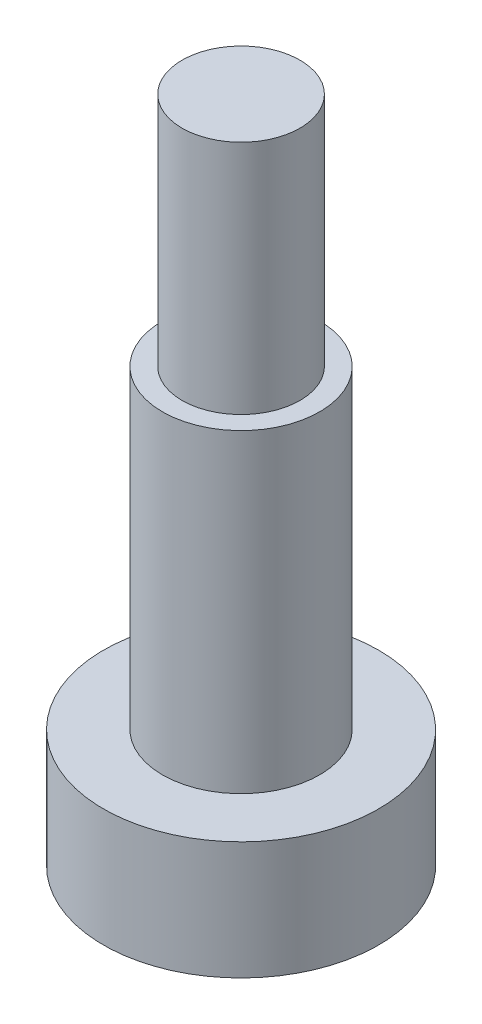
ISO-10303-21;
HEADER;
FILE_DESCRIPTION(('STEP AP214'),'2;1');
FILE_NAME('part.step','',(''),(''),'','','');
FILE_SCHEMA(('AUTOMOTIVE_DESIGN { 1 0 10303 214 1 1 1 1 }'));
ENDSEC;
DATA;
#1=APPLICATION_CONTEXT('core data for automotive mechanical design processes');
#2=APPLICATION_PROTOCOL_DEFINITION('international standard','automotive_design',2000,#1);
#3=PRODUCT_CONTEXT('',#1,'mechanical');
#4=PRODUCT('Part','Part','',(#3));
#5=PRODUCT_RELATED_PRODUCT_CATEGORY('part','',(#4));
#6=PRODUCT_DEFINITION_FORMATION('','',#4);
#7=PRODUCT_DEFINITION_CONTEXT('part definition',#1,'design');
#8=PRODUCT_DEFINITION('design','',#6,#7);
#9=PRODUCT_DEFINITION_SHAPE('','',#8);
#10=(LENGTH_UNIT() NAMED_UNIT(*) SI_UNIT(.MILLI.,.METRE.));
#11=(NAMED_UNIT(*) PLANE_ANGLE_UNIT() SI_UNIT($,.RADIAN.));
#12=(NAMED_UNIT(*) SI_UNIT($,.STERADIAN.) SOLID_ANGLE_UNIT());
#13=UNCERTAINTY_MEASURE_WITH_UNIT(LENGTH_MEASURE(1.E-05),#10,'distance_accuracy_value','');
#14=(GEOMETRIC_REPRESENTATION_CONTEXT(3) GLOBAL_UNCERTAINTY_ASSIGNED_CONTEXT((#13)) GLOBAL_UNIT_ASSIGNED_CONTEXT((#10,
#11,#12)) REPRESENTATION_CONTEXT('',''));
#15=CARTESIAN_POINT('',(0.,0.,0.));
#16=DIRECTION('',(0.,0.,1.));
#17=DIRECTION('',(1.,0.,0.));
#18=AXIS2_PLACEMENT_3D('',#15,#16,#17);
#19=CARTESIAN_POINT('',(0.,8.,0.));
#20=DIRECTION('',(0.,-1.,0.));
#21=DIRECTION('',(0.,0.,-1.));
#22=AXIS2_PLACEMENT_3D('',#19,#20,#21);
#23=CYLINDRICAL_SURFACE('',#22,2.);
#24=CARTESIAN_POINT('',(0.,8.,0.));
#25=DIRECTION('',(0.,1.,0.));
#26=DIRECTION('',(0.,0.,1.));
#27=AXIS2_PLACEMENT_3D('',#24,#25,#26);
#28=CIRCLE('',#27,2.);
#29=CARTESIAN_POINT('',(0.,8.,2.));
#30=VERTEX_POINT('',#29);
#31=EDGE_CURVE('E41',#30,#30,#28,.T.);
#32=ORIENTED_EDGE('',*,*,#31,.F.);
#33=EDGE_LOOP('',(#32));
#34=FACE_BOUND('',#33,.T.);
#35=CARTESIAN_POINT('',(0.,0.,0.));
#36=DIRECTION('',(0.,1.,0.));
#37=DIRECTION('',(0.,0.,1.));
#38=AXIS2_PLACEMENT_3D('',#35,#36,#37);
#39=CIRCLE('',#38,2.);
#40=CARTESIAN_POINT('',(0.,0.,2.));
#41=VERTEX_POINT('',#40);
#42=EDGE_CURVE('E37',#41,#41,#39,.T.);
#43=ORIENTED_EDGE('',*,*,#42,.T.);
#44=EDGE_LOOP('',(#43));
#45=FACE_BOUND('',#44,.T.);
#46=ADVANCED_FACE('F34',(#34,#45),#23,.T.);
#47=CARTESIAN_POINT('',(0.,8.,0.));
#48=DIRECTION('',(0.,1.,0.));
#49=DIRECTION('',(0.,0.,1.));
#50=AXIS2_PLACEMENT_3D('',#47,#48,#49);
#51=PLANE('',#50);
#52=CARTESIAN_POINT('',(0.,8.,0.));
#53=DIRECTION('',(0.,1.,0.));
#54=DIRECTION('',(0.,0.,1.));
#55=AXIS2_PLACEMENT_3D('',#52,#53,#54);
#56=CIRCLE('',#55,1.5);
#57=CARTESIAN_POINT('',(0.,8.,1.5));
#58=VERTEX_POINT('',#57);
#59=EDGE_CURVE('E10',#58,#58,#56,.T.);
#60=ORIENTED_EDGE('',*,*,#59,.F.);
#61=EDGE_LOOP('',(#60));
#62=FACE_BOUND('',#61,.T.);
#63=ORIENTED_EDGE('',*,*,#31,.T.);
#64=EDGE_LOOP('',(#63));
#65=FACE_BOUND('',#64,.T.);
#66=ADVANCED_FACE('F82',(#62,#65),#51,.T.);
#67=CARTESIAN_POINT('',(0.,14.,0.));
#68=DIRECTION('',(0.,-1.,0.));
#69=DIRECTION('',(0.,0.,-1.));
#70=AXIS2_PLACEMENT_3D('',#67,#68,#69);
#71=CYLINDRICAL_SURFACE('',#70,1.5);
#72=CARTESIAN_POINT('',(0.,14.,0.));
#73=DIRECTION('',(0.,1.,0.));
#74=DIRECTION('',(0.,0.,1.));
#75=AXIS2_PLACEMENT_3D('',#72,#73,#74);
#76=CIRCLE('',#75,1.5);
#77=CARTESIAN_POINT('',(0.,14.,1.5));
#78=VERTEX_POINT('',#77);
#79=EDGE_CURVE('E46',#78,#78,#76,.T.);
#80=ORIENTED_EDGE('',*,*,#79,.F.);
#81=EDGE_LOOP('',(#80));
#82=FACE_BOUND('',#81,.T.);
#83=ORIENTED_EDGE('',*,*,#59,.T.);
#84=EDGE_LOOP('',(#83));
#85=FACE_BOUND('',#84,.T.);
#86=ADVANCED_FACE('F78',(#82,#85),#71,.T.);
#87=CARTESIAN_POINT('',(0.,14.,0.));
#88=DIRECTION('',(0.,1.,0.));
#89=DIRECTION('',(0.,0.,1.));
#90=AXIS2_PLACEMENT_3D('',#87,#88,#89);
#91=PLANE('',#90);
#92=ORIENTED_EDGE('',*,*,#79,.T.);
#93=EDGE_LOOP('',(#92));
#94=FACE_BOUND('',#93,.T.);
#95=ADVANCED_FACE('F70',(#94),#91,.T.);
#96=CARTESIAN_POINT('',(0.,-3.,0.));
#97=DIRECTION('',(0.,1.,0.));
#98=DIRECTION('',(0.,0.,1.));
#99=AXIS2_PLACEMENT_3D('',#96,#97,#98);
#100=CYLINDRICAL_SURFACE('',#99,3.5);
#101=CARTESIAN_POINT('',(0.,-3.,0.));
#102=DIRECTION('',(0.,-1.,0.));
#103=DIRECTION('',(0.,0.,-1.));
#104=AXIS2_PLACEMENT_3D('',#101,#102,#103);
#105=CIRCLE('',#104,3.5);
#106=CARTESIAN_POINT('',(0.,-3.,-3.5));
#107=VERTEX_POINT('',#106);
#108=EDGE_CURVE('E53',#107,#107,#105,.T.);
#109=ORIENTED_EDGE('',*,*,#108,.F.);
#110=EDGE_LOOP('',(#109));
#111=FACE_BOUND('',#110,.T.);
#112=CARTESIAN_POINT('',(0.,0.,0.));
#113=DIRECTION('',(0.,-1.,0.));
#114=DIRECTION('',(0.,0.,-1.));
#115=AXIS2_PLACEMENT_3D('',#112,#113,#114);
#116=CIRCLE('',#115,3.5);
#117=CARTESIAN_POINT('',(0.,0.,-3.5));
#118=VERTEX_POINT('',#117);
#119=EDGE_CURVE('E50',#118,#118,#116,.T.);
#120=ORIENTED_EDGE('',*,*,#119,.T.);
#121=EDGE_LOOP('',(#120));
#122=FACE_BOUND('',#121,.T.);
#123=ADVANCED_FACE('F68',(#111,#122),#100,.T.);
#124=CARTESIAN_POINT('',(0.,-3.,0.));
#125=DIRECTION('',(0.,-1.,0.));
#126=DIRECTION('',(0.,0.,-1.));
#127=AXIS2_PLACEMENT_3D('',#124,#125,#126);
#128=PLANE('',#127);
#129=ORIENTED_EDGE('',*,*,#108,.T.);
#130=EDGE_LOOP('',(#129));
#131=FACE_BOUND('',#130,.T.);
#132=ADVANCED_FACE('F64',(#131),#128,.T.);
#133=CARTESIAN_POINT('',(0.,0.,0.));
#134=DIRECTION('',(0.,-1.,0.));
#135=DIRECTION('',(0.,0.,-1.));
#136=AXIS2_PLACEMENT_3D('',#133,#134,#135);
#137=PLANE('',#136);
#138=ORIENTED_EDGE('',*,*,#42,.F.);
#139=EDGE_LOOP('',(#138));
#140=FACE_BOUND('',#139,.T.);
#141=ORIENTED_EDGE('',*,*,#119,.F.);
#142=EDGE_LOOP('',(#141));
#143=FACE_BOUND('',#142,.T.);
#144=ADVANCED_FACE('F61',(#140,#143),#137,.F.);
#145=CLOSED_SHELL('',(#46,#66,#86,#95,#123,#132,#144));
#146=MANIFOLD_SOLID_BREP('B2',#145);
#147=ADVANCED_BREP_SHAPE_REPRESENTATION('',(#18,#146),#14);
#148=SHAPE_DEFINITION_REPRESENTATION(#9,#147);
ENDSEC;
END-ISO-10303-21;
